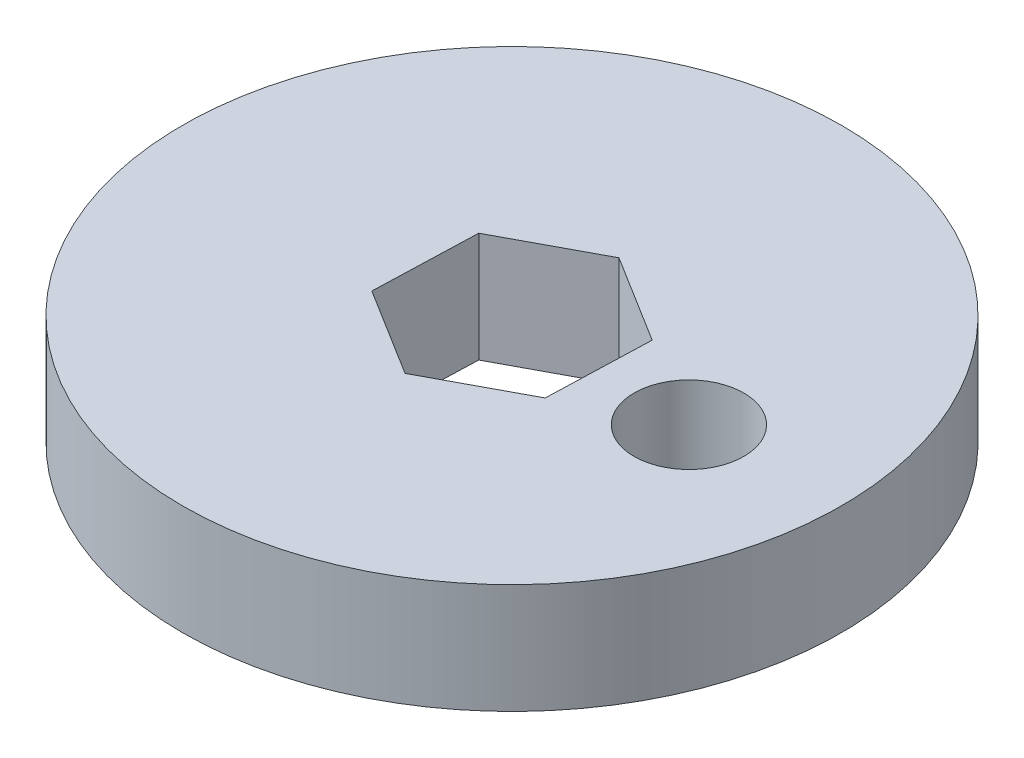
ISO-10303-21;
HEADER;
FILE_DESCRIPTION(('STEP AP214'),'2;1');
FILE_NAME('part.step','',(''),(''),'','','');
FILE_SCHEMA(('AUTOMOTIVE_DESIGN { 1 0 10303 214 1 1 1 1 }'));
ENDSEC;
DATA;
#1=APPLICATION_CONTEXT('core data for automotive mechanical design processes');
#2=APPLICATION_PROTOCOL_DEFINITION('international standard','automotive_design',2000,#1);
#3=PRODUCT_CONTEXT('',#1,'mechanical');
#4=PRODUCT('Part','Part','',(#3));
#5=PRODUCT_RELATED_PRODUCT_CATEGORY('part','',(#4));
#6=PRODUCT_DEFINITION_FORMATION('','',#4);
#7=PRODUCT_DEFINITION_CONTEXT('part definition',#1,'design');
#8=PRODUCT_DEFINITION('design','',#6,#7);
#9=PRODUCT_DEFINITION_SHAPE('','',#8);
#10=(LENGTH_UNIT() NAMED_UNIT(*) SI_UNIT(.MILLI.,.METRE.));
#11=(NAMED_UNIT(*) PLANE_ANGLE_UNIT() SI_UNIT($,.RADIAN.));
#12=(NAMED_UNIT(*) SI_UNIT($,.STERADIAN.) SOLID_ANGLE_UNIT());
#13=UNCERTAINTY_MEASURE_WITH_UNIT(LENGTH_MEASURE(1.E-05),#10,'distance_accuracy_value','');
#14=(GEOMETRIC_REPRESENTATION_CONTEXT(3) GLOBAL_UNCERTAINTY_ASSIGNED_CONTEXT((#13)) GLOBAL_UNIT_ASSIGNED_CONTEXT((#10,
#11,#12)) REPRESENTATION_CONTEXT('',''));
#15=CARTESIAN_POINT('',(0.,0.,0.));
#16=DIRECTION('',(0.,0.,1.));
#17=DIRECTION('',(1.,0.,0.));
#18=AXIS2_PLACEMENT_3D('',#15,#16,#17);
#19=CARTESIAN_POINT('',(0.,3.,0.));
#20=DIRECTION('',(0.,1.,0.));
#21=DIRECTION('',(0.,0.,1.));
#22=AXIS2_PLACEMENT_3D('',#19,#20,#21);
#23=PLANE('',#22);
#24=DIRECTION('',(-0.882038779829468,0.,0.471176814876267));
#25=VECTOR('',#24,1.);
#26=CARTESIAN_POINT('',(-2.40203424752393,3.,-1.49451156136562));
#27=LINE('',#26,#25);
#28=CARTESIAN_POINT('',(0.0932678546302105,3.,-2.82747845979876));
#29=VERTEX_POINT('',#28);
#30=CARTESIAN_POINT('',(-2.40203424752393,3.,-1.49451156136562));
#31=VERTEX_POINT('',#30);
#32=EDGE_CURVE('E104',#29,#31,#27,.T.);
#33=ORIENTED_EDGE('',*,*,#32,.F.);
#34=DIRECTION('',(-0.84907048127182,0.,-0.528279583017213));
#35=VECTOR('',#34,1.);
#36=CARTESIAN_POINT('',(0.0932678546302105,3.,-2.82747845979876));
#37=LINE('',#36,#35);
#38=CARTESIAN_POINT('',(2.49530210215414,3.,-1.33296689843314));
#39=VERTEX_POINT('',#38);
#40=EDGE_CURVE('E96',#39,#29,#37,.T.);
#41=ORIENTED_EDGE('',*,*,#40,.F.);
#42=DIRECTION('',(0.0329682985576479,0.,-0.999456397893482));
#43=VECTOR('',#42,1.);
#44=CARTESIAN_POINT('',(2.49530210215414,3.,-1.33296689843314));
#45=LINE('',#44,#43);
#46=CARTESIAN_POINT('',(2.40203424752392,3.,1.49451156136563));
#47=VERTEX_POINT('',#46);
#48=EDGE_CURVE('E126',#47,#39,#45,.T.);
#49=ORIENTED_EDGE('',*,*,#48,.F.);
#50=DIRECTION('',(0.882038779829468,0.,-0.471176814876267));
#51=VECTOR('',#50,1.);
#52=CARTESIAN_POINT('',(2.40203424752392,3.,1.49451156136563));
#53=LINE('',#52,#51);
#54=CARTESIAN_POINT('',(-0.0932678546302123,3.,2.82747845979877));
#55=VERTEX_POINT('',#54);
#56=EDGE_CURVE('E124',#55,#47,#53,.T.);
#57=ORIENTED_EDGE('',*,*,#56,.F.);
#58=DIRECTION('',(0.84907048127182,0.,0.528279583017213));
#59=VECTOR('',#58,1.);
#60=CARTESIAN_POINT('',(-0.0932678546302123,3.,2.82747845979877));
#61=LINE('',#60,#59);
#62=CARTESIAN_POINT('',(-2.49530210215414,3.,1.33296689843315));
#63=VERTEX_POINT('',#62);
#64=EDGE_CURVE('E119',#63,#55,#61,.T.);
#65=ORIENTED_EDGE('',*,*,#64,.F.);
#66=DIRECTION('',(-0.0329682985576478,0.,0.999456397893482));
#67=VECTOR('',#66,1.);
#68=CARTESIAN_POINT('',(-2.49530210215414,3.,1.33296689843315));
#69=LINE('',#68,#67);
#70=EDGE_CURVE('E117',#31,#63,#69,.T.);
#71=ORIENTED_EDGE('',*,*,#70,.F.);
#72=EDGE_LOOP('',(#33,#41,#49,#57,#65,#71));
#73=FACE_BOUND('',#72,.T.);
#74=CARTESIAN_POINT('',(0.,3.,0.));
#75=DIRECTION('',(0.,1.,0.));
#76=DIRECTION('',(0.,0.,1.));
#77=AXIS2_PLACEMENT_3D('',#74,#75,#76);
#78=CIRCLE('',#77,9.);
#79=CARTESIAN_POINT('',(0.,3.,9.));
#80=VERTEX_POINT('',#79);
#81=EDGE_CURVE('E11',#80,#80,#78,.T.);
#82=ORIENTED_EDGE('',*,*,#81,.T.);
#83=EDGE_LOOP('',(#82));
#84=FACE_BOUND('',#83,.T.);
#85=CARTESIAN_POINT('',(4.99728198946741,3.,0.16484149278824));
#86=DIRECTION('',(0.,1.,0.));
#87=DIRECTION('',(0.,0.,1.));
#88=AXIS2_PLACEMENT_3D('',#85,#86,#87);
#89=CIRCLE('',#88,1.5);
#90=CARTESIAN_POINT('',(4.99728198946741,3.,1.66484149278824));
#91=VERTEX_POINT('',#90);
#92=EDGE_CURVE('E129',#91,#91,#89,.T.);
#93=ORIENTED_EDGE('',*,*,#92,.F.);
#94=EDGE_LOOP('',(#93));
#95=FACE_BOUND('',#94,.T.);
#96=ADVANCED_FACE('F43',(#73,#84,#95),#23,.T.);
#97=CARTESIAN_POINT('',(0.,0.,0.));
#98=DIRECTION('',(0.,1.,0.));
#99=DIRECTION('',(0.,0.,1.));
#100=AXIS2_PLACEMENT_3D('',#97,#98,#99);
#101=PLANE('',#100);
#102=CARTESIAN_POINT('',(0.,0.,0.));
#103=DIRECTION('',(0.,1.,0.));
#104=DIRECTION('',(0.,0.,1.));
#105=AXIS2_PLACEMENT_3D('',#102,#103,#104);
#106=CIRCLE('',#105,9.);
#107=CARTESIAN_POINT('',(0.,0.,9.));
#108=VERTEX_POINT('',#107);
#109=EDGE_CURVE('E47',#108,#108,#106,.T.);
#110=ORIENTED_EDGE('',*,*,#109,.F.);
#111=EDGE_LOOP('',(#110));
#112=FACE_BOUND('',#111,.T.);
#113=DIRECTION('',(-0.84907048127182,0.,-0.528279583017213));
#114=VECTOR('',#113,1.);
#115=CARTESIAN_POINT('',(0.0932678546302105,0.,-2.82747845979876));
#116=LINE('',#115,#114);
#117=CARTESIAN_POINT('',(2.49530210215414,0.,-1.33296689843314));
#118=VERTEX_POINT('',#117);
#119=CARTESIAN_POINT('',(0.0932678546302105,0.,-2.82747845979876));
#120=VERTEX_POINT('',#119);
#121=EDGE_CURVE('E66',#118,#120,#116,.T.);
#122=ORIENTED_EDGE('',*,*,#121,.T.);
#123=DIRECTION('',(-0.882038779829468,0.,0.471176814876267));
#124=VECTOR('',#123,1.);
#125=CARTESIAN_POINT('',(-2.40203424752393,0.,-1.49451156136562));
#126=LINE('',#125,#124);
#127=CARTESIAN_POINT('',(-2.40203424752393,0.,-1.49451156136562));
#128=VERTEX_POINT('',#127);
#129=EDGE_CURVE('E111',#120,#128,#126,.T.);
#130=ORIENTED_EDGE('',*,*,#129,.T.);
#131=DIRECTION('',(-0.0329682985576478,0.,0.999456397893482));
#132=VECTOR('',#131,1.);
#133=CARTESIAN_POINT('',(-2.49530210215414,0.,1.33296689843315));
#134=LINE('',#133,#132);
#135=CARTESIAN_POINT('',(-2.49530210215414,0.,1.33296689843315));
#136=VERTEX_POINT('',#135);
#137=EDGE_CURVE('E131',#128,#136,#134,.T.);
#138=ORIENTED_EDGE('',*,*,#137,.T.);
#139=DIRECTION('',(0.84907048127182,0.,0.528279583017213));
#140=VECTOR('',#139,1.);
#141=CARTESIAN_POINT('',(-0.0932678546302123,0.,2.82747845979877));
#142=LINE('',#141,#140);
#143=CARTESIAN_POINT('',(-0.0932678546302123,0.,2.82747845979877));
#144=VERTEX_POINT('',#143);
#145=EDGE_CURVE('E134',#136,#144,#142,.T.);
#146=ORIENTED_EDGE('',*,*,#145,.T.);
#147=DIRECTION('',(0.882038779829468,0.,-0.471176814876267));
#148=VECTOR('',#147,1.);
#149=CARTESIAN_POINT('',(2.40203424752392,0.,1.49451156136563));
#150=LINE('',#149,#148);
#151=CARTESIAN_POINT('',(2.40203424752392,0.,1.49451156136563));
#152=VERTEX_POINT('',#151);
#153=EDGE_CURVE('E137',#144,#152,#150,.T.);
#154=ORIENTED_EDGE('',*,*,#153,.T.);
#155=DIRECTION('',(0.0329682985576479,0.,-0.999456397893482));
#156=VECTOR('',#155,1.);
#157=CARTESIAN_POINT('',(2.49530210215414,0.,-1.33296689843314));
#158=LINE('',#157,#156);
#159=EDGE_CURVE('E105',#152,#118,#158,.T.);
#160=ORIENTED_EDGE('',*,*,#159,.T.);
#161=EDGE_LOOP('',(#122,#130,#138,#146,#154,#160));
#162=FACE_BOUND('',#161,.T.);
#163=CARTESIAN_POINT('',(4.99728198946741,0.,0.16484149278824));
#164=DIRECTION('',(0.,1.,0.));
#165=DIRECTION('',(0.,0.,1.));
#166=AXIS2_PLACEMENT_3D('',#163,#164,#165);
#167=CIRCLE('',#166,1.5);
#168=CARTESIAN_POINT('',(4.99728198946741,0.,1.66484149278824));
#169=VERTEX_POINT('',#168);
#170=EDGE_CURVE('E229',#169,#169,#167,.T.);
#171=ORIENTED_EDGE('',*,*,#170,.T.);
#172=EDGE_LOOP('',(#171));
#173=FACE_BOUND('',#172,.T.);
#174=ADVANCED_FACE('F154',(#112,#162,#173),#101,.F.);
#175=CARTESIAN_POINT('',(0.,3.,0.));
#176=DIRECTION('',(0.,-1.,0.));
#177=DIRECTION('',(0.,0.,-1.));
#178=AXIS2_PLACEMENT_3D('',#175,#176,#177);
#179=CYLINDRICAL_SURFACE('',#178,9.);
#180=ORIENTED_EDGE('',*,*,#81,.F.);
#181=EDGE_LOOP('',(#180));
#182=FACE_BOUND('',#181,.T.);
#183=ORIENTED_EDGE('',*,*,#109,.T.);
#184=EDGE_LOOP('',(#183));
#185=FACE_BOUND('',#184,.T.);
#186=ADVANCED_FACE('F45',(#182,#185),#179,.T.);
#187=CARTESIAN_POINT('',(0.0932678546302105,3.,-2.82747845979876));
#188=DIRECTION('',(-0.528279583017213,0.,0.84907048127182));
#189=DIRECTION('',(0.84907048127182,0.,0.528279583017213));
#190=AXIS2_PLACEMENT_3D('',#187,#188,#189);
#191=PLANE('',#190);
#192=ORIENTED_EDGE('',*,*,#121,.F.);
#193=DIRECTION('',(0.,-1.,0.));
#194=VECTOR('',#193,1.);
#195=CARTESIAN_POINT('',(2.49530210215414,3.,-1.33296689843314));
#196=LINE('',#195,#194);
#197=EDGE_CURVE('E100',#39,#118,#196,.T.);
#198=ORIENTED_EDGE('',*,*,#197,.F.);
#199=ORIENTED_EDGE('',*,*,#40,.T.);
#200=DIRECTION('',(0.,-1.,0.));
#201=VECTOR('',#200,1.);
#202=CARTESIAN_POINT('',(0.0932678546302105,3.,-2.82747845979876));
#203=LINE('',#202,#201);
#204=EDGE_CURVE('E99',#29,#120,#203,.T.);
#205=ORIENTED_EDGE('',*,*,#204,.T.);
#206=EDGE_LOOP('',(#192,#198,#199,#205));
#207=FACE_BOUND('',#206,.T.);
#208=ADVANCED_FACE('F98',(#207),#191,.T.);
#209=CARTESIAN_POINT('',(-2.40203424752393,3.,-1.49451156136562));
#210=DIRECTION('',(0.471176814876267,0.,0.882038779829468));
#211=DIRECTION('',(0.882038779829468,0.,-0.471176814876267));
#212=AXIS2_PLACEMENT_3D('',#209,#210,#211);
#213=PLANE('',#212);
#214=ORIENTED_EDGE('',*,*,#129,.F.);
#215=ORIENTED_EDGE('',*,*,#204,.F.);
#216=ORIENTED_EDGE('',*,*,#32,.T.);
#217=DIRECTION('',(0.,-1.,0.));
#218=VECTOR('',#217,1.);
#219=CARTESIAN_POINT('',(-2.40203424752393,3.,-1.49451156136562));
#220=LINE('',#219,#218);
#221=EDGE_CURVE('E112',#31,#128,#220,.T.);
#222=ORIENTED_EDGE('',*,*,#221,.T.);
#223=EDGE_LOOP('',(#214,#215,#216,#222));
#224=FACE_BOUND('',#223,.T.);
#225=ADVANCED_FACE('F108',(#224),#213,.T.);
#226=CARTESIAN_POINT('',(-2.49530210215414,3.,1.33296689843315));
#227=DIRECTION('',(0.999456397893482,0.,0.0329682985576478));
#228=DIRECTION('',(0.0329682985576478,0.,-0.999456397893482));
#229=AXIS2_PLACEMENT_3D('',#226,#227,#228);
#230=PLANE('',#229);
#231=ORIENTED_EDGE('',*,*,#137,.F.);
#232=ORIENTED_EDGE('',*,*,#221,.F.);
#233=ORIENTED_EDGE('',*,*,#70,.T.);
#234=DIRECTION('',(0.,-1.,0.));
#235=VECTOR('',#234,1.);
#236=CARTESIAN_POINT('',(-2.49530210215414,3.,1.33296689843315));
#237=LINE('',#236,#235);
#238=EDGE_CURVE('E146',#63,#136,#237,.T.);
#239=ORIENTED_EDGE('',*,*,#238,.T.);
#240=EDGE_LOOP('',(#231,#232,#233,#239));
#241=FACE_BOUND('',#240,.T.);
#242=ADVANCED_FACE('F150',(#241),#230,.T.);
#243=CARTESIAN_POINT('',(-0.0932678546302123,3.,2.82747845979877));
#244=DIRECTION('',(0.528279583017213,0.,-0.84907048127182));
#245=DIRECTION('',(-0.84907048127182,0.,-0.528279583017213));
#246=AXIS2_PLACEMENT_3D('',#243,#244,#245);
#247=PLANE('',#246);
#248=ORIENTED_EDGE('',*,*,#145,.F.);
#249=ORIENTED_EDGE('',*,*,#238,.F.);
#250=ORIENTED_EDGE('',*,*,#64,.T.);
#251=DIRECTION('',(0.,-1.,0.));
#252=VECTOR('',#251,1.);
#253=CARTESIAN_POINT('',(-0.0932678546302123,3.,2.82747845979877));
#254=LINE('',#253,#252);
#255=EDGE_CURVE('E144',#55,#144,#254,.T.);
#256=ORIENTED_EDGE('',*,*,#255,.T.);
#257=EDGE_LOOP('',(#248,#249,#250,#256));
#258=FACE_BOUND('',#257,.T.);
#259=ADVANCED_FACE('F163',(#258),#247,.T.);
#260=CARTESIAN_POINT('',(2.40203424752392,3.,1.49451156136563));
#261=DIRECTION('',(-0.471176814876267,0.,-0.882038779829468));
#262=DIRECTION('',(-0.882038779829468,0.,0.471176814876267));
#263=AXIS2_PLACEMENT_3D('',#260,#261,#262);
#264=PLANE('',#263);
#265=ORIENTED_EDGE('',*,*,#153,.F.);
#266=ORIENTED_EDGE('',*,*,#255,.F.);
#267=ORIENTED_EDGE('',*,*,#56,.T.);
#268=DIRECTION('',(0.,-1.,0.));
#269=VECTOR('',#268,1.);
#270=CARTESIAN_POINT('',(2.40203424752392,3.,1.49451156136563));
#271=LINE('',#270,#269);
#272=EDGE_CURVE('E58',#47,#152,#271,.T.);
#273=ORIENTED_EDGE('',*,*,#272,.T.);
#274=EDGE_LOOP('',(#265,#266,#267,#273));
#275=FACE_BOUND('',#274,.T.);
#276=ADVANCED_FACE('F161',(#275),#264,.T.);
#277=CARTESIAN_POINT('',(2.49530210215414,3.,-1.33296689843314));
#278=DIRECTION('',(-0.999456397893482,0.,-0.0329682985576479));
#279=DIRECTION('',(-0.0329682985576479,0.,0.999456397893482));
#280=AXIS2_PLACEMENT_3D('',#277,#278,#279);
#281=PLANE('',#280);
#282=ORIENTED_EDGE('',*,*,#159,.F.);
#283=ORIENTED_EDGE('',*,*,#272,.F.);
#284=ORIENTED_EDGE('',*,*,#48,.T.);
#285=ORIENTED_EDGE('',*,*,#197,.T.);
#286=EDGE_LOOP('',(#282,#283,#284,#285));
#287=FACE_BOUND('',#286,.T.);
#288=ADVANCED_FACE('F157',(#287),#281,.T.);
#289=CARTESIAN_POINT('',(4.99728198946741,3.,0.16484149278824));
#290=DIRECTION('',(0.,-1.,0.));
#291=DIRECTION('',(0.,0.,-1.));
#292=AXIS2_PLACEMENT_3D('',#289,#290,#291);
#293=CYLINDRICAL_SURFACE('',#292,1.5);
#294=ORIENTED_EDGE('',*,*,#92,.T.);
#295=EDGE_LOOP('',(#294));
#296=FACE_BOUND('',#295,.T.);
#297=ORIENTED_EDGE('',*,*,#170,.F.);
#298=EDGE_LOOP('',(#297));
#299=FACE_BOUND('',#298,.T.);
#300=ADVANCED_FACE('F212',(#296,#299),#293,.F.);
#301=CLOSED_SHELL('',(#96,#174,#186,#208,#225,#242,#259,#276,#288,#300));
#302=MANIFOLD_SOLID_BREP('B2',#301);
#303=ADVANCED_BREP_SHAPE_REPRESENTATION('',(#18,#302),#14);
#304=SHAPE_DEFINITION_REPRESENTATION(#9,#303);
ENDSEC;
END-ISO-10303-21;
